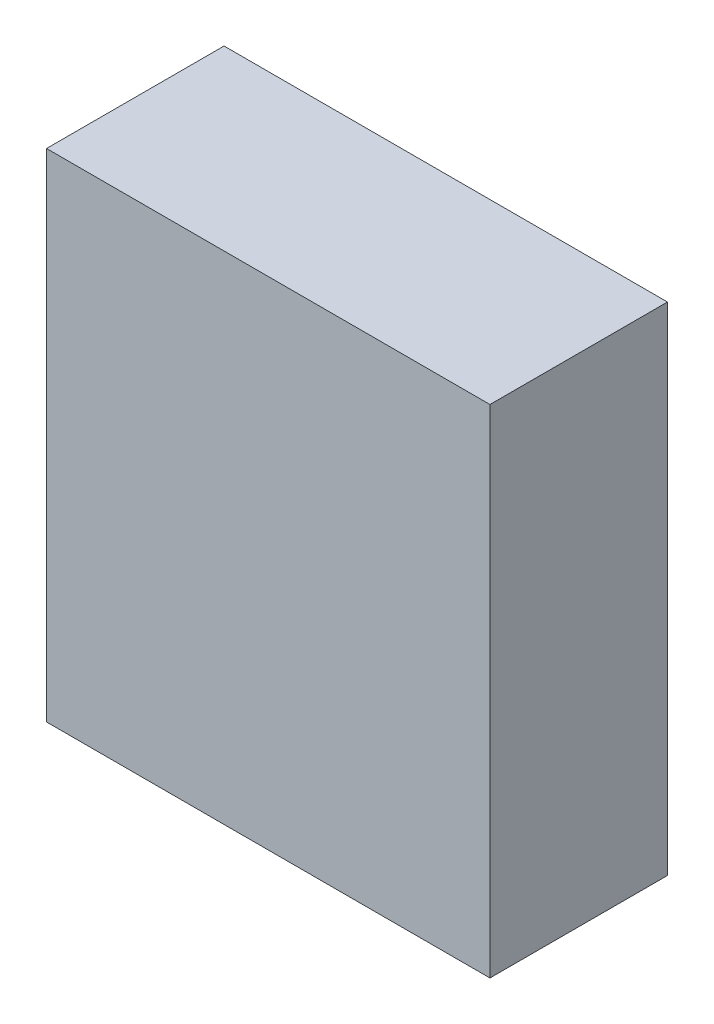
ISO-10303-21;
HEADER;
FILE_DESCRIPTION(('STEP AP214'),'2;1');
FILE_NAME('part.step','',(''),(''),'','','');
FILE_SCHEMA(('AUTOMOTIVE_DESIGN { 1 0 10303 214 1 1 1 1 }'));
ENDSEC;
DATA;
#1=APPLICATION_CONTEXT('core data for automotive mechanical design processes');
#2=APPLICATION_PROTOCOL_DEFINITION('international standard','automotive_design',2000,#1);
#3=PRODUCT_CONTEXT('',#1,'mechanical');
#4=PRODUCT('Part','Part','',(#3));
#5=PRODUCT_RELATED_PRODUCT_CATEGORY('part','',(#4));
#6=PRODUCT_DEFINITION_FORMATION('','',#4);
#7=PRODUCT_DEFINITION_CONTEXT('part definition',#1,'design');
#8=PRODUCT_DEFINITION('design','',#6,#7);
#9=PRODUCT_DEFINITION_SHAPE('','',#8);
#10=(LENGTH_UNIT() NAMED_UNIT(*) SI_UNIT(.MILLI.,.METRE.));
#11=(NAMED_UNIT(*) PLANE_ANGLE_UNIT() SI_UNIT($,.RADIAN.));
#12=(NAMED_UNIT(*) SI_UNIT($,.STERADIAN.) SOLID_ANGLE_UNIT());
#13=UNCERTAINTY_MEASURE_WITH_UNIT(LENGTH_MEASURE(1.E-05),#10,'distance_accuracy_value','');
#14=(GEOMETRIC_REPRESENTATION_CONTEXT(3) GLOBAL_UNCERTAINTY_ASSIGNED_CONTEXT((#13)) GLOBAL_UNIT_ASSIGNED_CONTEXT((#10,
#11,#12)) REPRESENTATION_CONTEXT('',''));
#15=CARTESIAN_POINT('',(0.,0.,0.));
#16=DIRECTION('',(0.,0.,1.));
#17=DIRECTION('',(1.,0.,0.));
#18=AXIS2_PLACEMENT_3D('',#15,#16,#17);
#19=CARTESIAN_POINT('',(0.,0.,0.50000154));
#20=DIRECTION('',(0.,0.,-1.));
#21=DIRECTION('',(-1.,0.,0.));
#22=AXIS2_PLACEMENT_3D('',#19,#20,#21);
#23=PLANE('',#22);
#24=DIRECTION('',(1.,0.,0.));
#25=VECTOR('',#24,1.);
#26=CARTESIAN_POINT('',(0.62449202,-0.69949314,0.50000154));
#27=LINE('',#26,#25);
#28=CARTESIAN_POINT('',(0.62449202,-0.69949314,0.50000154));
#29=VERTEX_POINT('',#28);
#30=CARTESIAN_POINT('',(-0.62449202,-0.69949314,0.50000154));
#31=VERTEX_POINT('',#30);
#32=EDGE_CURVE('E68',#29,#31,#27,.F.);
#33=ORIENTED_EDGE('',*,*,#32,.F.);
#34=DIRECTION('',(0.,1.,0.));
#35=VECTOR('',#34,1.);
#36=CARTESIAN_POINT('',(0.62449202,0.69949314,0.50000154));
#37=LINE('',#36,#35);
#38=CARTESIAN_POINT('',(0.62449202,0.69949314,0.50000154));
#39=VERTEX_POINT('',#38);
#40=EDGE_CURVE('E55',#39,#29,#37,.F.);
#41=ORIENTED_EDGE('',*,*,#40,.F.);
#42=DIRECTION('',(1.,0.,0.));
#43=VECTOR('',#42,1.);
#44=CARTESIAN_POINT('',(-0.62449202,0.69949314,0.50000154));
#45=LINE('',#44,#43);
#46=CARTESIAN_POINT('',(-0.62449202,0.69949314,0.50000154));
#47=VERTEX_POINT('',#46);
#48=EDGE_CURVE('E20',#47,#39,#45,.T.);
#49=ORIENTED_EDGE('',*,*,#48,.F.);
#50=DIRECTION('',(0.,1.,0.));
#51=VECTOR('',#50,1.);
#52=CARTESIAN_POINT('',(-0.62449202,-0.69949314,0.50000154));
#53=LINE('',#52,#51);
#54=EDGE_CURVE('E80',#31,#47,#53,.T.);
#55=ORIENTED_EDGE('',*,*,#54,.F.);
#56=EDGE_LOOP('',(#33,#41,#49,#55));
#57=FACE_BOUND('',#56,.T.);
#58=ADVANCED_FACE('F17',(#57),#23,.F.);
#59=CARTESIAN_POINT('',(-0.62449202,0.69949314,0.));
#60=DIRECTION('',(0.,1.,0.));
#61=DIRECTION('',(0.,0.,1.));
#62=AXIS2_PLACEMENT_3D('',#59,#60,#61);
#63=PLANE('',#62);
#64=DIRECTION('',(0.,0.,-1.));
#65=VECTOR('',#64,1.);
#66=CARTESIAN_POINT('',(0.62449202,0.69949314,0.));
#67=LINE('',#66,#65);
#68=CARTESIAN_POINT('',(0.62449202,0.69949314,0.));
#69=VERTEX_POINT('',#68);
#70=EDGE_CURVE('E61',#69,#39,#67,.F.);
#71=ORIENTED_EDGE('',*,*,#70,.F.);
#72=DIRECTION('',(-1.,0.,0.));
#73=VECTOR('',#72,1.);
#74=CARTESIAN_POINT('',(0.,0.69949314,0.));
#75=LINE('',#74,#73);
#76=CARTESIAN_POINT('',(-0.62449202,0.69949314,0.));
#77=VERTEX_POINT('',#76);
#78=EDGE_CURVE('E83',#77,#69,#75,.F.);
#79=ORIENTED_EDGE('',*,*,#78,.F.);
#80=DIRECTION('',(0.,0.,1.));
#81=VECTOR('',#80,1.);
#82=CARTESIAN_POINT('',(-0.62449202,0.69949314,0.));
#83=LINE('',#82,#81);
#84=EDGE_CURVE('E64',#47,#77,#83,.F.);
#85=ORIENTED_EDGE('',*,*,#84,.F.);
#86=ORIENTED_EDGE('',*,*,#48,.T.);
#87=EDGE_LOOP('',(#71,#79,#85,#86));
#88=FACE_BOUND('',#87,.T.);
#89=ADVANCED_FACE('F60',(#88),#63,.T.);
#90=CARTESIAN_POINT('',(0.62449202,0.69949314,0.));
#91=DIRECTION('',(1.,0.,0.));
#92=DIRECTION('',(0.,0.,-1.));
#93=AXIS2_PLACEMENT_3D('',#90,#91,#92);
#94=PLANE('',#93);
#95=DIRECTION('',(0.,0.,-1.));
#96=VECTOR('',#95,1.);
#97=CARTESIAN_POINT('',(0.62449202,-0.69949314,0.));
#98=LINE('',#97,#96);
#99=CARTESIAN_POINT('',(0.62449202,-0.69949314,0.));
#100=VERTEX_POINT('',#99);
#101=EDGE_CURVE('E70',#100,#29,#98,.F.);
#102=ORIENTED_EDGE('',*,*,#101,.F.);
#103=DIRECTION('',(0.,1.,0.));
#104=VECTOR('',#103,1.);
#105=CARTESIAN_POINT('',(0.62449202,0.,0.));
#106=LINE('',#105,#104);
#107=EDGE_CURVE('E74',#69,#100,#106,.F.);
#108=ORIENTED_EDGE('',*,*,#107,.F.);
#109=ORIENTED_EDGE('',*,*,#70,.T.);
#110=ORIENTED_EDGE('',*,*,#40,.T.);
#111=EDGE_LOOP('',(#102,#108,#109,#110));
#112=FACE_BOUND('',#111,.T.);
#113=ADVANCED_FACE('F72',(#112),#94,.T.);
#114=CARTESIAN_POINT('',(0.62449202,-0.69949314,0.));
#115=DIRECTION('',(0.,-1.,0.));
#116=DIRECTION('',(0.,0.,-1.));
#117=AXIS2_PLACEMENT_3D('',#114,#115,#116);
#118=PLANE('',#117);
#119=DIRECTION('',(0.,0.,1.));
#120=VECTOR('',#119,1.);
#121=CARTESIAN_POINT('',(-0.62449202,-0.69949314,0.));
#122=LINE('',#121,#120);
#123=CARTESIAN_POINT('',(-0.62449202,-0.69949314,0.));
#124=VERTEX_POINT('',#123);
#125=EDGE_CURVE('E35',#124,#31,#122,.T.);
#126=ORIENTED_EDGE('',*,*,#125,.F.);
#127=DIRECTION('',(-1.,0.,0.));
#128=VECTOR('',#127,1.);
#129=CARTESIAN_POINT('',(0.,-0.69949314,0.));
#130=LINE('',#129,#128);
#131=EDGE_CURVE('E26',#100,#124,#130,.T.);
#132=ORIENTED_EDGE('',*,*,#131,.F.);
#133=ORIENTED_EDGE('',*,*,#101,.T.);
#134=ORIENTED_EDGE('',*,*,#32,.T.);
#135=EDGE_LOOP('',(#126,#132,#133,#134));
#136=FACE_BOUND('',#135,.T.);
#137=ADVANCED_FACE('F89',(#136),#118,.T.);
#138=CARTESIAN_POINT('',(-0.62449202,-0.69949314,0.));
#139=DIRECTION('',(-1.,0.,0.));
#140=DIRECTION('',(0.,0.,1.));
#141=AXIS2_PLACEMENT_3D('',#138,#139,#140);
#142=PLANE('',#141);
#143=ORIENTED_EDGE('',*,*,#84,.T.);
#144=DIRECTION('',(0.,1.,0.));
#145=VECTOR('',#144,1.);
#146=CARTESIAN_POINT('',(-0.62449202,0.,0.));
#147=LINE('',#146,#145);
#148=EDGE_CURVE('E11',#124,#77,#147,.T.);
#149=ORIENTED_EDGE('',*,*,#148,.F.);
#150=ORIENTED_EDGE('',*,*,#125,.T.);
#151=ORIENTED_EDGE('',*,*,#54,.T.);
#152=EDGE_LOOP('',(#143,#149,#150,#151));
#153=FACE_BOUND('',#152,.T.);
#154=ADVANCED_FACE('F91',(#153),#142,.T.);
#155=CARTESIAN_POINT('',(0.,0.,0.));
#156=DIRECTION('',(0.,0.,-1.));
#157=DIRECTION('',(-1.,0.,0.));
#158=AXIS2_PLACEMENT_3D('',#155,#156,#157);
#159=PLANE('',#158);
#160=ORIENTED_EDGE('',*,*,#131,.T.);
#161=ORIENTED_EDGE('',*,*,#148,.T.);
#162=ORIENTED_EDGE('',*,*,#78,.T.);
#163=ORIENTED_EDGE('',*,*,#107,.T.);
#164=EDGE_LOOP('',(#160,#161,#162,#163));
#165=FACE_BOUND('',#164,.T.);
#166=ADVANCED_FACE('F88',(#165),#159,.T.);
#167=CLOSED_SHELL('',(#58,#89,#113,#137,#154,#166));
#168=MANIFOLD_SOLID_BREP('B1',#167);
#169=ADVANCED_BREP_SHAPE_REPRESENTATION('',(#18,#168),#14);
#170=SHAPE_DEFINITION_REPRESENTATION(#9,#169);
ENDSEC;
END-ISO-10303-21;
